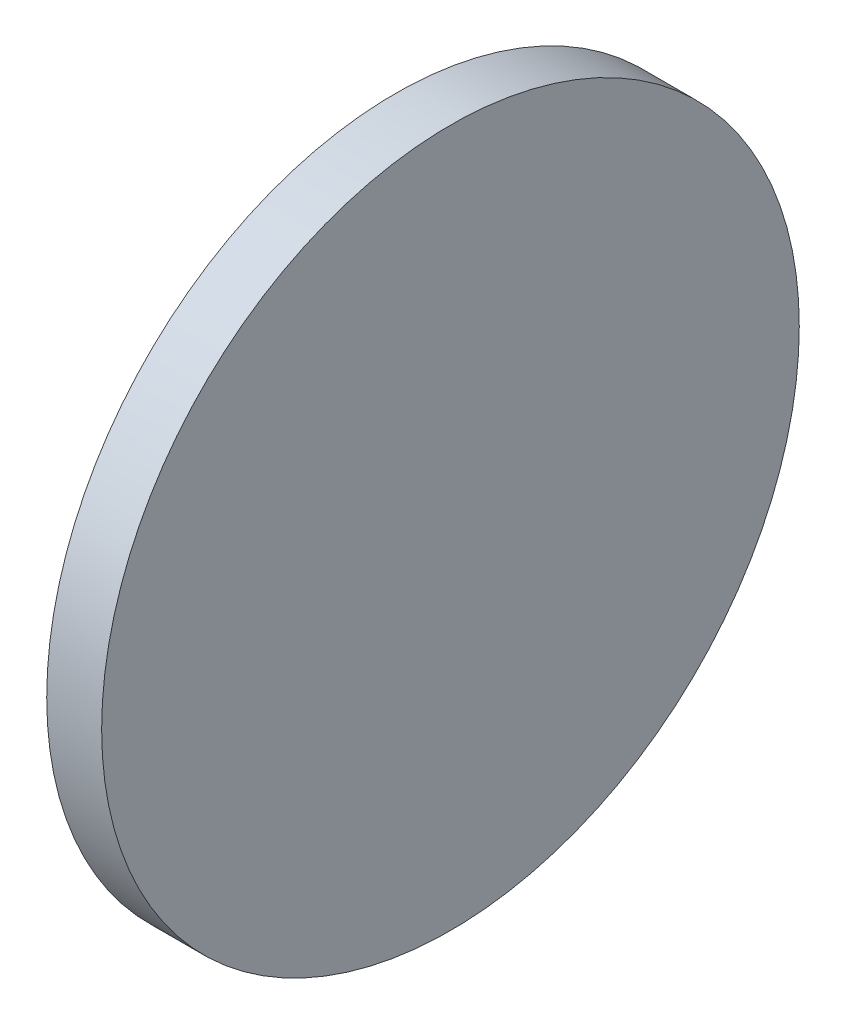
ISO-10303-21;
HEADER;
FILE_DESCRIPTION(('STEP AP214'),'2;1');
FILE_NAME('part.step','',(''),(''),'','','');
FILE_SCHEMA(('AUTOMOTIVE_DESIGN { 1 0 10303 214 1 1 1 1 }'));
ENDSEC;
DATA;
#1=APPLICATION_CONTEXT('core data for automotive mechanical design processes');
#2=APPLICATION_PROTOCOL_DEFINITION('international standard','automotive_design',2000,#1);
#3=PRODUCT_CONTEXT('',#1,'mechanical');
#4=PRODUCT('Part','Part','',(#3));
#5=PRODUCT_RELATED_PRODUCT_CATEGORY('part','',(#4));
#6=PRODUCT_DEFINITION_FORMATION('','',#4);
#7=PRODUCT_DEFINITION_CONTEXT('part definition',#1,'design');
#8=PRODUCT_DEFINITION('design','',#6,#7);
#9=PRODUCT_DEFINITION_SHAPE('','',#8);
#10=(LENGTH_UNIT() NAMED_UNIT(*) SI_UNIT(.MILLI.,.METRE.));
#11=(NAMED_UNIT(*) PLANE_ANGLE_UNIT() SI_UNIT($,.RADIAN.));
#12=(NAMED_UNIT(*) SI_UNIT($,.STERADIAN.) SOLID_ANGLE_UNIT());
#13=UNCERTAINTY_MEASURE_WITH_UNIT(LENGTH_MEASURE(1.E-05),#10,'distance_accuracy_value','');
#14=(GEOMETRIC_REPRESENTATION_CONTEXT(3) GLOBAL_UNCERTAINTY_ASSIGNED_CONTEXT((#13)) GLOBAL_UNIT_ASSIGNED_CONTEXT((#10,
#11,#12)) REPRESENTATION_CONTEXT('',''));
#15=CARTESIAN_POINT('',(0.,0.,0.));
#16=DIRECTION('',(0.,0.,1.));
#17=DIRECTION('',(1.,0.,0.));
#18=AXIS2_PLACEMENT_3D('',#15,#16,#17);
#19=CARTESIAN_POINT('',(175.877409758404,57.3101466561398,0.));
#20=DIRECTION('',(-1.,0.,0.));
#21=DIRECTION('',(0.,0.,1.));
#22=AXIS2_PLACEMENT_3D('',#19,#20,#21);
#23=PLANE('',#22);
#24=CARTESIAN_POINT('',(175.877409758404,57.3101466561398,0.));
#25=DIRECTION('',(-1.,0.,0.));
#26=DIRECTION('',(0.,0.,1.));
#27=AXIS2_PLACEMENT_3D('',#24,#25,#26);
#28=CIRCLE('',#27,12.7);
#29=CARTESIAN_POINT('',(175.877409758404,57.3101466561398,12.7));
#30=VERTEX_POINT('',#29);
#31=EDGE_CURVE('E10',#30,#30,#28,.T.);
#32=ORIENTED_EDGE('',*,*,#31,.F.);
#33=EDGE_LOOP('',(#32));
#34=FACE_BOUND('',#33,.T.);
#35=ADVANCED_FACE('F35',(#34),#23,.F.);
#36=CARTESIAN_POINT('',(168.247513707247,57.3101466561398,0.));
#37=DIRECTION('',(-1.,0.,0.));
#38=DIRECTION('',(0.,0.,1.));
#39=AXIS2_PLACEMENT_3D('',#36,#37,#38);
#40=CYLINDRICAL_SURFACE('',#39,12.7);
#41=CARTESIAN_POINT('',(173.877409758404,57.3101466561398,0.));
#42=DIRECTION('',(-1.,0.,0.));
#43=DIRECTION('',(0.,0.,1.));
#44=AXIS2_PLACEMENT_3D('',#41,#42,#43);
#45=CIRCLE('',#44,12.7);
#46=CARTESIAN_POINT('',(173.877409758404,57.3101466561398,12.7));
#47=VERTEX_POINT('',#46);
#48=EDGE_CURVE('E41',#47,#47,#45,.T.);
#49=ORIENTED_EDGE('',*,*,#48,.F.);
#50=EDGE_LOOP('',(#49));
#51=FACE_BOUND('',#50,.T.);
#52=ORIENTED_EDGE('',*,*,#31,.T.);
#53=EDGE_LOOP('',(#52));
#54=FACE_BOUND('',#53,.T.);
#55=ADVANCED_FACE('F49',(#51,#54),#40,.T.);
#56=CARTESIAN_POINT('',(173.877409758404,57.3101466561398,0.));
#57=DIRECTION('',(1.,0.,0.));
#58=DIRECTION('',(0.,0.,-1.));
#59=AXIS2_PLACEMENT_3D('',#56,#57,#58);
#60=PLANE('',#59);
#61=ORIENTED_EDGE('',*,*,#48,.T.);
#62=EDGE_LOOP('',(#61));
#63=FACE_BOUND('',#62,.T.);
#64=ADVANCED_FACE('F47',(#63),#60,.F.);
#65=CLOSED_SHELL('',(#35,#55,#64));
#66=MANIFOLD_SOLID_BREP('B2',#65);
#67=ADVANCED_BREP_SHAPE_REPRESENTATION('',(#18,#66),#14);
#68=SHAPE_DEFINITION_REPRESENTATION(#9,#67);
ENDSEC;
END-ISO-10303-21;
